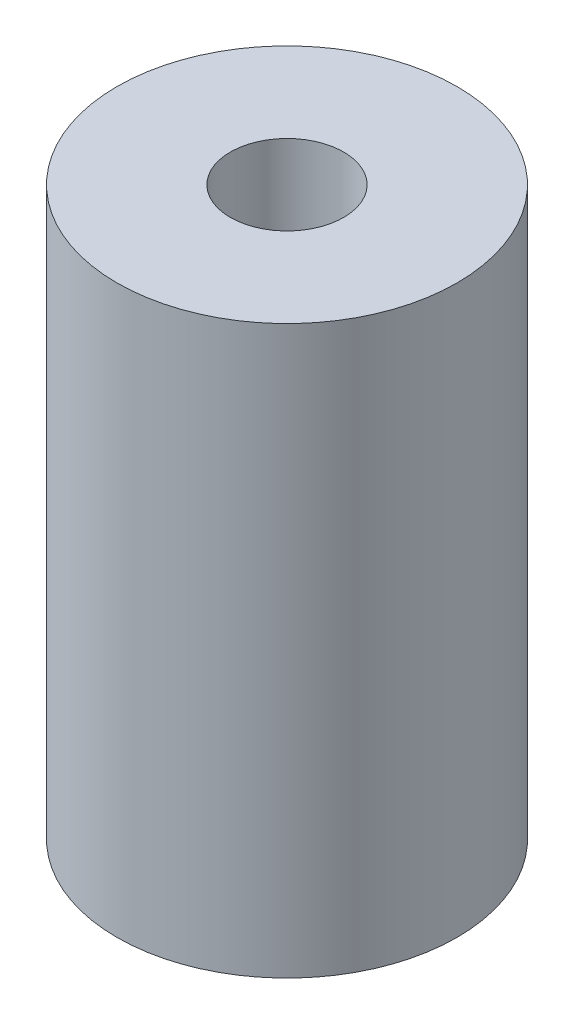
ISO-10303-21;
HEADER;
FILE_DESCRIPTION(('STEP AP214'),'2;1');
FILE_NAME('part.step','',(''),(''),'','','');
FILE_SCHEMA(('AUTOMOTIVE_DESIGN { 1 0 10303 214 1 1 1 1 }'));
ENDSEC;
DATA;
#1=APPLICATION_CONTEXT('core data for automotive mechanical design processes');
#2=APPLICATION_PROTOCOL_DEFINITION('international standard','automotive_design',2000,#1);
#3=PRODUCT_CONTEXT('',#1,'mechanical');
#4=PRODUCT('Part','Part','',(#3));
#5=PRODUCT_RELATED_PRODUCT_CATEGORY('part','',(#4));
#6=PRODUCT_DEFINITION_FORMATION('','',#4);
#7=PRODUCT_DEFINITION_CONTEXT('part definition',#1,'design');
#8=PRODUCT_DEFINITION('design','',#6,#7);
#9=PRODUCT_DEFINITION_SHAPE('','',#8);
#10=(LENGTH_UNIT() NAMED_UNIT(*) SI_UNIT(.MILLI.,.METRE.));
#11=(NAMED_UNIT(*) PLANE_ANGLE_UNIT() SI_UNIT($,.RADIAN.));
#12=(NAMED_UNIT(*) SI_UNIT($,.STERADIAN.) SOLID_ANGLE_UNIT());
#13=UNCERTAINTY_MEASURE_WITH_UNIT(LENGTH_MEASURE(1.E-05),#10,'distance_accuracy_value','');
#14=(GEOMETRIC_REPRESENTATION_CONTEXT(3) GLOBAL_UNCERTAINTY_ASSIGNED_CONTEXT((#13)) GLOBAL_UNIT_ASSIGNED_CONTEXT((#10,
#11,#12)) REPRESENTATION_CONTEXT('',''));
#15=CARTESIAN_POINT('',(0.,0.,0.));
#16=DIRECTION('',(0.,0.,1.));
#17=DIRECTION('',(1.,0.,0.));
#18=AXIS2_PLACEMENT_3D('',#15,#16,#17);
#19=CARTESIAN_POINT('',(0.,50.,0.));
#20=DIRECTION('',(0.,1.,0.));
#21=DIRECTION('',(0.,0.,1.));
#22=AXIS2_PLACEMENT_3D('',#19,#20,#21);
#23=PLANE('',#22);
#24=CARTESIAN_POINT('',(0.,50.,0.));
#25=DIRECTION('',(0.,1.,0.));
#26=DIRECTION('',(0.,0.,1.));
#27=AXIS2_PLACEMENT_3D('',#24,#25,#26);
#28=CIRCLE('',#27,15.);
#29=CARTESIAN_POINT('',(0.,50.,15.));
#30=VERTEX_POINT('',#29);
#31=EDGE_CURVE('E10',#30,#30,#28,.T.);
#32=ORIENTED_EDGE('',*,*,#31,.T.);
#33=EDGE_LOOP('',(#32));
#34=FACE_BOUND('',#33,.T.);
#35=CARTESIAN_POINT('',(0.,50.,0.));
#36=DIRECTION('',(0.,1.,0.));
#37=DIRECTION('',(0.,0.,1.));
#38=AXIS2_PLACEMENT_3D('',#35,#36,#37);
#39=CIRCLE('',#38,5.);
#40=CARTESIAN_POINT('',(0.,50.,5.));
#41=VERTEX_POINT('',#40);
#42=EDGE_CURVE('E45',#41,#41,#39,.T.);
#43=ORIENTED_EDGE('',*,*,#42,.F.);
#44=EDGE_LOOP('',(#43));
#45=FACE_BOUND('',#44,.T.);
#46=ADVANCED_FACE('F34',(#34,#45),#23,.T.);
#47=CARTESIAN_POINT('',(0.,0.,0.));
#48=DIRECTION('',(0.,1.,0.));
#49=DIRECTION('',(0.,0.,1.));
#50=AXIS2_PLACEMENT_3D('',#47,#48,#49);
#51=PLANE('',#50);
#52=CARTESIAN_POINT('',(0.,0.,0.));
#53=DIRECTION('',(0.,1.,0.));
#54=DIRECTION('',(0.,0.,1.));
#55=AXIS2_PLACEMENT_3D('',#52,#53,#54);
#56=CIRCLE('',#55,15.);
#57=CARTESIAN_POINT('',(0.,0.,15.));
#58=VERTEX_POINT('',#57);
#59=EDGE_CURVE('E38',#58,#58,#56,.T.);
#60=ORIENTED_EDGE('',*,*,#59,.F.);
#61=EDGE_LOOP('',(#60));
#62=FACE_BOUND('',#61,.T.);
#63=CARTESIAN_POINT('',(0.,0.,0.));
#64=DIRECTION('',(0.,1.,0.));
#65=DIRECTION('',(0.,0.,1.));
#66=AXIS2_PLACEMENT_3D('',#63,#64,#65);
#67=CIRCLE('',#66,5.);
#68=CARTESIAN_POINT('',(0.,0.,5.));
#69=VERTEX_POINT('',#68);
#70=EDGE_CURVE('E47',#69,#69,#67,.T.);
#71=ORIENTED_EDGE('',*,*,#70,.T.);
#72=EDGE_LOOP('',(#71));
#73=FACE_BOUND('',#72,.T.);
#74=ADVANCED_FACE('F57',(#62,#73),#51,.F.);
#75=CARTESIAN_POINT('',(0.,50.,0.));
#76=DIRECTION('',(0.,-1.,0.));
#77=DIRECTION('',(0.,0.,-1.));
#78=AXIS2_PLACEMENT_3D('',#75,#76,#77);
#79=CYLINDRICAL_SURFACE('',#78,15.);
#80=ORIENTED_EDGE('',*,*,#31,.F.);
#81=EDGE_LOOP('',(#80));
#82=FACE_BOUND('',#81,.T.);
#83=ORIENTED_EDGE('',*,*,#59,.T.);
#84=EDGE_LOOP('',(#83));
#85=FACE_BOUND('',#84,.T.);
#86=ADVANCED_FACE('F36',(#82,#85),#79,.T.);
#87=CARTESIAN_POINT('',(0.,50.,0.));
#88=DIRECTION('',(0.,-1.,0.));
#89=DIRECTION('',(0.,0.,-1.));
#90=AXIS2_PLACEMENT_3D('',#87,#88,#89);
#91=CYLINDRICAL_SURFACE('',#90,5.);
#92=ORIENTED_EDGE('',*,*,#42,.T.);
#93=EDGE_LOOP('',(#92));
#94=FACE_BOUND('',#93,.T.);
#95=ORIENTED_EDGE('',*,*,#70,.F.);
#96=EDGE_LOOP('',(#95));
#97=FACE_BOUND('',#96,.T.);
#98=ADVANCED_FACE('F53',(#94,#97),#91,.F.);
#99=CLOSED_SHELL('',(#46,#74,#86,#98));
#100=MANIFOLD_SOLID_BREP('B2',#99);
#101=ADVANCED_BREP_SHAPE_REPRESENTATION('',(#18,#100),#14);
#102=SHAPE_DEFINITION_REPRESENTATION(#9,#101);
ENDSEC;
END-ISO-10303-21;
